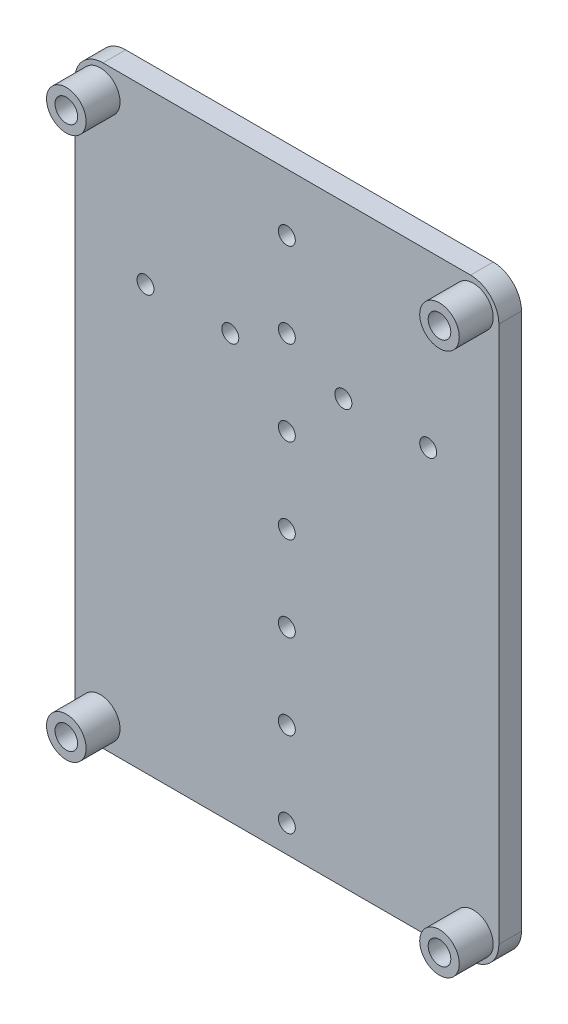
ISO-10303-21;
HEADER;
FILE_DESCRIPTION(('STEP AP214'),'2;1');
FILE_NAME('part.step','',(''),(''),'','','');
FILE_SCHEMA(('AUTOMOTIVE_DESIGN { 1 0 10303 214 1 1 1 1 }'));
ENDSEC;
DATA;
#1=APPLICATION_CONTEXT('core data for automotive mechanical design processes');
#2=APPLICATION_PROTOCOL_DEFINITION('international standard','automotive_design',2000,#1);
#3=PRODUCT_CONTEXT('',#1,'mechanical');
#4=PRODUCT('Part','Part','',(#3));
#5=PRODUCT_RELATED_PRODUCT_CATEGORY('part','',(#4));
#6=PRODUCT_DEFINITION_FORMATION('','',#4);
#7=PRODUCT_DEFINITION_CONTEXT('part definition',#1,'design');
#8=PRODUCT_DEFINITION('design','',#6,#7);
#9=PRODUCT_DEFINITION_SHAPE('','',#8);
#10=(LENGTH_UNIT() NAMED_UNIT(*) SI_UNIT(.MILLI.,.METRE.));
#11=(NAMED_UNIT(*) PLANE_ANGLE_UNIT() SI_UNIT($,.RADIAN.));
#12=(NAMED_UNIT(*) SI_UNIT($,.STERADIAN.) SOLID_ANGLE_UNIT());
#13=UNCERTAINTY_MEASURE_WITH_UNIT(LENGTH_MEASURE(1.E-05),#10,'distance_accuracy_value','');
#14=(GEOMETRIC_REPRESENTATION_CONTEXT(3) GLOBAL_UNCERTAINTY_ASSIGNED_CONTEXT((#13)) GLOBAL_UNIT_ASSIGNED_CONTEXT((#10,
#11,#12)) REPRESENTATION_CONTEXT('',''));
#15=CARTESIAN_POINT('',(0.,0.,0.));
#16=DIRECTION('',(0.,0.,1.));
#17=DIRECTION('',(1.,0.,0.));
#18=AXIS2_PLACEMENT_3D('',#15,#16,#17);
#19=CARTESIAN_POINT('',(0.,0.,116.694714262562));
#20=DIRECTION('',(0.,0.,-1.));
#21=DIRECTION('',(-1.,0.,0.));
#22=AXIS2_PLACEMENT_3D('',#19,#20,#21);
#23=PLANE('',#22);
#24=CARTESIAN_POINT('',(101.526557276723,64.3119182077676,116.694714262562));
#25=DIRECTION('',(0.,0.,-1.));
#26=DIRECTION('',(-1.,0.,0.));
#27=AXIS2_PLACEMENT_3D('',#24,#25,#26);
#28=CIRCLE('',#27,3.50000000000001);
#29=CARTESIAN_POINT('',(98.0265572767228,64.3119182077676,116.694714262562));
#30=VERTEX_POINT('',#29);
#31=EDGE_CURVE('E139',#30,#30,#28,.F.);
#32=ORIENTED_EDGE('',*,*,#31,.F.);
#33=EDGE_LOOP('',(#32));
#34=FACE_BOUND('',#33,.T.);
#35=CARTESIAN_POINT('',(101.526557276723,160.311918207768,116.694714262562));
#36=DIRECTION('',(0.,0.,-1.));
#37=DIRECTION('',(-1.,0.,0.));
#38=AXIS2_PLACEMENT_3D('',#35,#36,#37);
#39=CIRCLE('',#38,3.50000000000001);
#40=CARTESIAN_POINT('',(98.0265572767228,160.311918207768,116.694714262562));
#41=VERTEX_POINT('',#40);
#42=EDGE_CURVE('E132',#41,#41,#39,.F.);
#43=ORIENTED_EDGE('',*,*,#42,.F.);
#44=EDGE_LOOP('',(#43));
#45=FACE_BOUND('',#44,.T.);
#46=DIRECTION('',(0.,1.,0.));
#47=VECTOR('',#46,1.);
#48=CARTESIAN_POINT('',(97.0265572767228,164.811918207768,116.694714262562));
#49=LINE('',#48,#47);
#50=CARTESIAN_POINT('',(97.0265572767228,64.8119182077676,116.694714262562));
#51=VERTEX_POINT('',#50);
#52=CARTESIAN_POINT('',(97.0265572767228,159.811918207768,116.694714262562));
#53=VERTEX_POINT('',#52);
#54=EDGE_CURVE('E115',#51,#53,#49,.T.);
#55=ORIENTED_EDGE('',*,*,#54,.F.);
#56=CARTESIAN_POINT('',(102.026557276723,64.8119182077676,116.694714262562));
#57=DIRECTION('',(0.,0.,-1.));
#58=DIRECTION('',(-1.,0.,0.));
#59=AXIS2_PLACEMENT_3D('',#56,#57,#58);
#60=CIRCLE('',#59,5.);
#61=CARTESIAN_POINT('',(102.026557276723,59.8119182077676,116.694714262562));
#62=VERTEX_POINT('',#61);
#63=EDGE_CURVE('E98',#51,#62,#60,.F.);
#64=ORIENTED_EDGE('',*,*,#63,.T.);
#65=DIRECTION('',(-1.,0.,0.));
#66=VECTOR('',#65,1.);
#67=CARTESIAN_POINT('',(172.026557276723,59.8119182077676,116.694714262562));
#68=LINE('',#67,#66);
#69=CARTESIAN_POINT('',(167.026557276723,59.8119182077676,116.694714262562));
#70=VERTEX_POINT('',#69);
#71=EDGE_CURVE('E124',#70,#62,#68,.T.);
#72=ORIENTED_EDGE('',*,*,#71,.F.);
#73=CARTESIAN_POINT('',(167.026557276723,64.8119182077676,116.694714262562));
#74=DIRECTION('',(0.,0.,-1.));
#75=DIRECTION('',(-1.,0.,0.));
#76=AXIS2_PLACEMENT_3D('',#73,#74,#75);
#77=CIRCLE('',#76,5.);
#78=CARTESIAN_POINT('',(172.026557276723,64.8119182077676,116.694714262562));
#79=VERTEX_POINT('',#78);
#80=EDGE_CURVE('E109',#70,#79,#77,.F.);
#81=ORIENTED_EDGE('',*,*,#80,.T.);
#82=DIRECTION('',(0.,-1.,0.));
#83=VECTOR('',#82,1.);
#84=CARTESIAN_POINT('',(172.026557276723,164.811918207768,116.694714262562));
#85=LINE('',#84,#83);
#86=CARTESIAN_POINT('',(172.026557276723,159.811918207768,116.694714262562));
#87=VERTEX_POINT('',#86);
#88=EDGE_CURVE('E128',#87,#79,#85,.T.);
#89=ORIENTED_EDGE('',*,*,#88,.F.);
#90=CARTESIAN_POINT('',(167.026557276723,159.811918207768,116.694714262562));
#91=DIRECTION('',(0.,0.,-1.));
#92=DIRECTION('',(-1.,0.,0.));
#93=AXIS2_PLACEMENT_3D('',#90,#91,#92);
#94=CIRCLE('',#93,5.);
#95=CARTESIAN_POINT('',(167.026557276723,164.811918207768,116.694714262562));
#96=VERTEX_POINT('',#95);
#97=EDGE_CURVE('E147',#87,#96,#94,.F.);
#98=ORIENTED_EDGE('',*,*,#97,.T.);
#99=DIRECTION('',(1.,0.,0.));
#100=VECTOR('',#99,1.);
#101=CARTESIAN_POINT('',(172.026557276723,164.811918207768,116.694714262562));
#102=LINE('',#101,#100);
#103=CARTESIAN_POINT('',(102.026557276723,164.811918207768,116.694714262562));
#104=VERTEX_POINT('',#103);
#105=EDGE_CURVE('E123',#104,#96,#102,.T.);
#106=ORIENTED_EDGE('',*,*,#105,.F.);
#107=CARTESIAN_POINT('',(102.026557276723,159.811918207768,116.694714262562));
#108=DIRECTION('',(0.,0.,-1.));
#109=DIRECTION('',(-1.,0.,0.));
#110=AXIS2_PLACEMENT_3D('',#107,#108,#109);
#111=CIRCLE('',#110,5.);
#112=EDGE_CURVE('E118',#104,#53,#111,.F.);
#113=ORIENTED_EDGE('',*,*,#112,.T.);
#114=EDGE_LOOP('',(#55,#64,#72,#81,#89,#98,#106,#113));
#115=FACE_BOUND('',#114,.T.);
#116=CARTESIAN_POINT('',(134.526557276723,154.637085274738,116.694714262562));
#117=DIRECTION('',(0.,0.,-1.));
#118=DIRECTION('',(-1.,0.,0.));
#119=AXIS2_PLACEMENT_3D('',#116,#117,#118);
#120=CIRCLE('',#119,1.5);
#121=CARTESIAN_POINT('',(133.026557276723,154.637085274738,116.694714262562));
#122=VERTEX_POINT('',#121);
#123=EDGE_CURVE('E185',#122,#122,#120,.T.);
#124=ORIENTED_EDGE('',*,*,#123,.T.);
#125=EDGE_LOOP('',(#124));
#126=FACE_BOUND('',#125,.T.);
#127=CARTESIAN_POINT('',(134.526557276723,139.637085274738,116.694714262562));
#128=DIRECTION('',(0.,0.,-1.));
#129=DIRECTION('',(-1.,0.,0.));
#130=AXIS2_PLACEMENT_3D('',#127,#128,#129);
#131=CIRCLE('',#130,1.5);
#132=CARTESIAN_POINT('',(133.026557276723,139.637085274738,116.694714262562));
#133=VERTEX_POINT('',#132);
#134=EDGE_CURVE('E196',#133,#133,#131,.T.);
#135=ORIENTED_EDGE('',*,*,#134,.T.);
#136=EDGE_LOOP('',(#135));
#137=FACE_BOUND('',#136,.T.);
#138=CARTESIAN_POINT('',(144.526557276723,134.637085274738,116.694714262562));
#139=DIRECTION('',(0.,0.,-1.));
#140=DIRECTION('',(-1.,0.,0.));
#141=AXIS2_PLACEMENT_3D('',#138,#139,#140);
#142=CIRCLE('',#141,1.50000000000002);
#143=CARTESIAN_POINT('',(143.026557276723,134.637085274738,116.694714262562));
#144=VERTEX_POINT('',#143);
#145=EDGE_CURVE('E202',#144,#144,#142,.T.);
#146=ORIENTED_EDGE('',*,*,#145,.T.);
#147=EDGE_LOOP('',(#146));
#148=FACE_BOUND('',#147,.T.);
#149=CARTESIAN_POINT('',(159.526557276723,134.637085274738,116.694714262562));
#150=DIRECTION('',(0.,0.,-1.));
#151=DIRECTION('',(-1.,0.,0.));
#152=AXIS2_PLACEMENT_3D('',#149,#150,#151);
#153=CIRCLE('',#152,1.5);
#154=CARTESIAN_POINT('',(158.026557276723,134.637085274738,116.694714262562));
#155=VERTEX_POINT('',#154);
#156=EDGE_CURVE('E208',#155,#155,#153,.T.);
#157=ORIENTED_EDGE('',*,*,#156,.T.);
#158=EDGE_LOOP('',(#157));
#159=FACE_BOUND('',#158,.T.);
#160=CARTESIAN_POINT('',(124.526557276723,134.637085274738,116.694714262562));
#161=DIRECTION('',(0.,0.,-1.));
#162=DIRECTION('',(-1.,0.,0.));
#163=AXIS2_PLACEMENT_3D('',#160,#161,#162);
#164=CIRCLE('',#163,1.50000000000002);
#165=CARTESIAN_POINT('',(123.026557276723,134.637085274738,116.694714262562));
#166=VERTEX_POINT('',#165);
#167=EDGE_CURVE('E214',#166,#166,#164,.T.);
#168=ORIENTED_EDGE('',*,*,#167,.T.);
#169=EDGE_LOOP('',(#168));
#170=FACE_BOUND('',#169,.T.);
#171=CARTESIAN_POINT('',(109.526557276723,134.637085274738,116.694714262562));
#172=DIRECTION('',(0.,0.,-1.));
#173=DIRECTION('',(-1.,0.,0.));
#174=AXIS2_PLACEMENT_3D('',#171,#172,#173);
#175=CIRCLE('',#174,1.5);
#176=CARTESIAN_POINT('',(108.026557276723,134.637085274738,116.694714262562));
#177=VERTEX_POINT('',#176);
#178=EDGE_CURVE('E220',#177,#177,#175,.T.);
#179=ORIENTED_EDGE('',*,*,#178,.T.);
#180=EDGE_LOOP('',(#179));
#181=FACE_BOUND('',#180,.T.);
#182=CARTESIAN_POINT('',(134.526557276723,124.637085274738,116.694714262562));
#183=DIRECTION('',(0.,0.,-1.));
#184=DIRECTION('',(-1.,0.,0.));
#185=AXIS2_PLACEMENT_3D('',#182,#183,#184);
#186=CIRCLE('',#185,1.5);
#187=CARTESIAN_POINT('',(133.026557276723,124.637085274738,116.694714262562));
#188=VERTEX_POINT('',#187);
#189=EDGE_CURVE('E226',#188,#188,#186,.T.);
#190=ORIENTED_EDGE('',*,*,#189,.T.);
#191=EDGE_LOOP('',(#190));
#192=FACE_BOUND('',#191,.T.);
#193=CARTESIAN_POINT('',(134.526557276723,109.637085274738,116.694714262562));
#194=DIRECTION('',(0.,0.,-1.));
#195=DIRECTION('',(-1.,0.,0.));
#196=AXIS2_PLACEMENT_3D('',#193,#194,#195);
#197=CIRCLE('',#196,1.5);
#198=CARTESIAN_POINT('',(133.026557276723,109.637085274738,116.694714262562));
#199=VERTEX_POINT('',#198);
#200=EDGE_CURVE('E232',#199,#199,#197,.T.);
#201=ORIENTED_EDGE('',*,*,#200,.T.);
#202=EDGE_LOOP('',(#201));
#203=FACE_BOUND('',#202,.T.);
#204=CARTESIAN_POINT('',(134.526557276723,94.6370852747384,116.694714262562));
#205=DIRECTION('',(0.,0.,-1.));
#206=DIRECTION('',(-1.,0.,0.));
#207=AXIS2_PLACEMENT_3D('',#204,#205,#206);
#208=CIRCLE('',#207,1.5);
#209=CARTESIAN_POINT('',(133.026557276723,94.6370852747384,116.694714262562));
#210=VERTEX_POINT('',#209);
#211=EDGE_CURVE('E238',#210,#210,#208,.T.);
#212=ORIENTED_EDGE('',*,*,#211,.T.);
#213=EDGE_LOOP('',(#212));
#214=FACE_BOUND('',#213,.T.);
#215=CARTESIAN_POINT('',(134.526557276723,79.6370852747385,116.694714262562));
#216=DIRECTION('',(0.,0.,-1.));
#217=DIRECTION('',(-1.,0.,0.));
#218=AXIS2_PLACEMENT_3D('',#215,#216,#217);
#219=CIRCLE('',#218,1.5);
#220=CARTESIAN_POINT('',(133.026557276723,79.6370852747385,116.694714262562));
#221=VERTEX_POINT('',#220);
#222=EDGE_CURVE('E244',#221,#221,#219,.T.);
#223=ORIENTED_EDGE('',*,*,#222,.T.);
#224=EDGE_LOOP('',(#223));
#225=FACE_BOUND('',#224,.T.);
#226=CARTESIAN_POINT('',(134.526557276723,64.6370852747385,116.694714262562));
#227=DIRECTION('',(0.,0.,-1.));
#228=DIRECTION('',(-1.,0.,0.));
#229=AXIS2_PLACEMENT_3D('',#226,#227,#228);
#230=CIRCLE('',#229,1.5);
#231=CARTESIAN_POINT('',(133.026557276723,64.6370852747385,116.694714262562));
#232=VERTEX_POINT('',#231);
#233=EDGE_CURVE('E250',#232,#232,#230,.T.);
#234=ORIENTED_EDGE('',*,*,#233,.T.);
#235=EDGE_LOOP('',(#234));
#236=FACE_BOUND('',#235,.T.);
#237=CARTESIAN_POINT('',(167.526557276723,160.311918207768,116.694714262562));
#238=DIRECTION('',(0.,0.,-1.));
#239=DIRECTION('',(-1.,0.,0.));
#240=AXIS2_PLACEMENT_3D('',#237,#238,#239);
#241=CIRCLE('',#240,3.49999999999999);
#242=CARTESIAN_POINT('',(164.026557276723,160.311918207768,116.694714262562));
#243=VERTEX_POINT('',#242);
#244=EDGE_CURVE('E135',#243,#243,#241,.F.);
#245=ORIENTED_EDGE('',*,*,#244,.F.);
#246=EDGE_LOOP('',(#245));
#247=FACE_BOUND('',#246,.T.);
#248=CARTESIAN_POINT('',(167.526557276723,64.3119182077676,116.694714262562));
#249=DIRECTION('',(0.,0.,-1.));
#250=DIRECTION('',(-1.,0.,0.));
#251=AXIS2_PLACEMENT_3D('',#248,#249,#250);
#252=CIRCLE('',#251,3.49999999999999);
#253=CARTESIAN_POINT('',(164.026557276723,64.3119182077676,116.694714262562));
#254=VERTEX_POINT('',#253);
#255=EDGE_CURVE('E142',#254,#254,#252,.F.);
#256=ORIENTED_EDGE('',*,*,#255,.F.);
#257=EDGE_LOOP('',(#256));
#258=FACE_BOUND('',#257,.T.);
#259=ADVANCED_FACE('F33',(#34,#45,#115,#126,#137,#148,#159,#170,#181,#192,#203,#214,#225,#236,
#247,#258),#23,.F.);
#260=CARTESIAN_POINT('',(0.,0.,112.694714262562));
#261=DIRECTION('',(0.,0.,-1.));
#262=DIRECTION('',(-1.,0.,0.));
#263=AXIS2_PLACEMENT_3D('',#260,#261,#262);
#264=PLANE('',#263);
#265=CARTESIAN_POINT('',(101.526557276723,160.311918207768,112.694714262562));
#266=DIRECTION('',(0.,0.,-1.));
#267=DIRECTION('',(-1.,0.,0.));
#268=AXIS2_PLACEMENT_3D('',#265,#266,#267);
#269=CIRCLE('',#268,2.);
#270=CARTESIAN_POINT('',(99.5265572767228,160.311918207768,112.694714262562));
#271=VERTEX_POINT('',#270);
#272=EDGE_CURVE('E261',#271,#271,#269,.T.);
#273=ORIENTED_EDGE('',*,*,#272,.F.);
#274=EDGE_LOOP('',(#273));
#275=FACE_BOUND('',#274,.T.);
#276=CARTESIAN_POINT('',(167.526557276723,64.3119182077676,112.694714262562));
#277=DIRECTION('',(0.,0.,-1.));
#278=DIRECTION('',(-1.,0.,0.));
#279=AXIS2_PLACEMENT_3D('',#276,#277,#278);
#280=CIRCLE('',#279,2.);
#281=CARTESIAN_POINT('',(165.526557276723,64.3119182077676,112.694714262562));
#282=VERTEX_POINT('',#281);
#283=EDGE_CURVE('E253',#282,#282,#280,.T.);
#284=ORIENTED_EDGE('',*,*,#283,.F.);
#285=EDGE_LOOP('',(#284));
#286=FACE_BOUND('',#285,.T.);
#287=CARTESIAN_POINT('',(134.526557276723,79.6370852747385,112.694714262562));
#288=DIRECTION('',(0.,0.,-1.));
#289=DIRECTION('',(-1.,0.,0.));
#290=AXIS2_PLACEMENT_3D('',#287,#288,#289);
#291=CIRCLE('',#290,1.5);
#292=CARTESIAN_POINT('',(133.026557276723,79.6370852747385,112.694714262562));
#293=VERTEX_POINT('',#292);
#294=EDGE_CURVE('E241',#293,#293,#291,.T.);
#295=ORIENTED_EDGE('',*,*,#294,.F.);
#296=EDGE_LOOP('',(#295));
#297=FACE_BOUND('',#296,.T.);
#298=CARTESIAN_POINT('',(134.526557276723,109.637085274738,112.694714262562));
#299=DIRECTION('',(0.,0.,-1.));
#300=DIRECTION('',(-1.,0.,0.));
#301=AXIS2_PLACEMENT_3D('',#298,#299,#300);
#302=CIRCLE('',#301,1.5);
#303=CARTESIAN_POINT('',(133.026557276723,109.637085274738,112.694714262562));
#304=VERTEX_POINT('',#303);
#305=EDGE_CURVE('E229',#304,#304,#302,.T.);
#306=ORIENTED_EDGE('',*,*,#305,.F.);
#307=EDGE_LOOP('',(#306));
#308=FACE_BOUND('',#307,.T.);
#309=CARTESIAN_POINT('',(109.526557276723,134.637085274738,112.694714262562));
#310=DIRECTION('',(0.,0.,-1.));
#311=DIRECTION('',(-1.,0.,0.));
#312=AXIS2_PLACEMENT_3D('',#309,#310,#311);
#313=CIRCLE('',#312,1.5);
#314=CARTESIAN_POINT('',(108.026557276723,134.637085274738,112.694714262562));
#315=VERTEX_POINT('',#314);
#316=EDGE_CURVE('E217',#315,#315,#313,.T.);
#317=ORIENTED_EDGE('',*,*,#316,.F.);
#318=EDGE_LOOP('',(#317));
#319=FACE_BOUND('',#318,.T.);
#320=CARTESIAN_POINT('',(159.526557276723,134.637085274738,112.694714262562));
#321=DIRECTION('',(0.,0.,-1.));
#322=DIRECTION('',(-1.,0.,0.));
#323=AXIS2_PLACEMENT_3D('',#320,#321,#322);
#324=CIRCLE('',#323,1.5);
#325=CARTESIAN_POINT('',(158.026557276723,134.637085274738,112.694714262562));
#326=VERTEX_POINT('',#325);
#327=EDGE_CURVE('E205',#326,#326,#324,.T.);
#328=ORIENTED_EDGE('',*,*,#327,.F.);
#329=EDGE_LOOP('',(#328));
#330=FACE_BOUND('',#329,.T.);
#331=CARTESIAN_POINT('',(134.526557276723,139.637085274738,112.694714262562));
#332=DIRECTION('',(0.,0.,-1.));
#333=DIRECTION('',(-1.,0.,0.));
#334=AXIS2_PLACEMENT_3D('',#331,#332,#333);
#335=CIRCLE('',#334,1.5);
#336=CARTESIAN_POINT('',(133.026557276723,139.637085274738,112.694714262562));
#337=VERTEX_POINT('',#336);
#338=EDGE_CURVE('E194',#337,#337,#335,.T.);
#339=ORIENTED_EDGE('',*,*,#338,.F.);
#340=EDGE_LOOP('',(#339));
#341=FACE_BOUND('',#340,.T.);
#342=DIRECTION('',(-1.,0.,0.));
#343=VECTOR('',#342,1.);
#344=CARTESIAN_POINT('',(172.026557276723,59.8119182077676,112.694714262562));
#345=LINE('',#344,#343);
#346=CARTESIAN_POINT('',(167.026557276723,59.8119182077676,112.694714262562));
#347=VERTEX_POINT('',#346);
#348=CARTESIAN_POINT('',(102.026557276723,59.8119182077676,112.694714262562));
#349=VERTEX_POINT('',#348);
#350=EDGE_CURVE('E180',#347,#349,#345,.T.);
#351=ORIENTED_EDGE('',*,*,#350,.T.);
#352=CARTESIAN_POINT('',(102.026557276723,64.8119182077676,112.694714262562));
#353=DIRECTION('',(0.,0.,-1.));
#354=DIRECTION('',(-1.,0.,0.));
#355=AXIS2_PLACEMENT_3D('',#352,#353,#354);
#356=CIRCLE('',#355,5.);
#357=CARTESIAN_POINT('',(97.0265572767228,64.8119182077676,112.694714262562));
#358=VERTEX_POINT('',#357);
#359=EDGE_CURVE('E158',#349,#358,#356,.T.);
#360=ORIENTED_EDGE('',*,*,#359,.T.);
#361=DIRECTION('',(0.,1.,0.));
#362=VECTOR('',#361,1.);
#363=CARTESIAN_POINT('',(97.0265572767228,164.811918207768,112.694714262562));
#364=LINE('',#363,#362);
#365=CARTESIAN_POINT('',(97.0265572767228,159.811918207768,112.694714262562));
#366=VERTEX_POINT('',#365);
#367=EDGE_CURVE('E117',#358,#366,#364,.T.);
#368=ORIENTED_EDGE('',*,*,#367,.T.);
#369=CARTESIAN_POINT('',(102.026557276723,159.811918207768,112.694714262562));
#370=DIRECTION('',(0.,0.,-1.));
#371=DIRECTION('',(-1.,0.,0.));
#372=AXIS2_PLACEMENT_3D('',#369,#370,#371);
#373=CIRCLE('',#372,5.);
#374=CARTESIAN_POINT('',(102.026557276723,164.811918207768,112.694714262562));
#375=VERTEX_POINT('',#374);
#376=EDGE_CURVE('E53',#366,#375,#373,.T.);
#377=ORIENTED_EDGE('',*,*,#376,.T.);
#378=DIRECTION('',(1.,0.,0.));
#379=VECTOR('',#378,1.);
#380=CARTESIAN_POINT('',(172.026557276723,164.811918207768,112.694714262562));
#381=LINE('',#380,#379);
#382=CARTESIAN_POINT('',(167.026557276723,164.811918207768,112.694714262562));
#383=VERTEX_POINT('',#382);
#384=EDGE_CURVE('E136',#375,#383,#381,.T.);
#385=ORIENTED_EDGE('',*,*,#384,.T.);
#386=CARTESIAN_POINT('',(167.026557276723,159.811918207768,112.694714262562));
#387=DIRECTION('',(0.,0.,-1.));
#388=DIRECTION('',(-1.,0.,0.));
#389=AXIS2_PLACEMENT_3D('',#386,#387,#388);
#390=CIRCLE('',#389,5.);
#391=CARTESIAN_POINT('',(172.026557276723,159.811918207768,112.694714262562));
#392=VERTEX_POINT('',#391);
#393=EDGE_CURVE('E154',#383,#392,#390,.T.);
#394=ORIENTED_EDGE('',*,*,#393,.T.);
#395=DIRECTION('',(0.,-1.,0.));
#396=VECTOR('',#395,1.);
#397=CARTESIAN_POINT('',(172.026557276723,164.811918207768,112.694714262562));
#398=LINE('',#397,#396);
#399=CARTESIAN_POINT('',(172.026557276723,64.8119182077676,112.694714262562));
#400=VERTEX_POINT('',#399);
#401=EDGE_CURVE('E126',#392,#400,#398,.T.);
#402=ORIENTED_EDGE('',*,*,#401,.T.);
#403=CARTESIAN_POINT('',(167.026557276723,64.8119182077676,112.694714262562));
#404=DIRECTION('',(0.,0.,-1.));
#405=DIRECTION('',(-1.,0.,0.));
#406=AXIS2_PLACEMENT_3D('',#403,#404,#405);
#407=CIRCLE('',#406,5.);
#408=EDGE_CURVE('E156',#400,#347,#407,.T.);
#409=ORIENTED_EDGE('',*,*,#408,.T.);
#410=EDGE_LOOP('',(#351,#360,#368,#377,#385,#394,#402,#409));
#411=FACE_BOUND('',#410,.T.);
#412=CARTESIAN_POINT('',(134.526557276723,154.637085274738,112.694714262562));
#413=DIRECTION('',(0.,0.,-1.));
#414=DIRECTION('',(-1.,0.,0.));
#415=AXIS2_PLACEMENT_3D('',#412,#413,#414);
#416=CIRCLE('',#415,1.5);
#417=CARTESIAN_POINT('',(133.026557276723,154.637085274738,112.694714262562));
#418=VERTEX_POINT('',#417);
#419=EDGE_CURVE('E189',#418,#418,#416,.T.);
#420=ORIENTED_EDGE('',*,*,#419,.F.);
#421=EDGE_LOOP('',(#420));
#422=FACE_BOUND('',#421,.T.);
#423=CARTESIAN_POINT('',(144.526557276723,134.637085274738,112.694714262562));
#424=DIRECTION('',(0.,0.,-1.));
#425=DIRECTION('',(-1.,0.,0.));
#426=AXIS2_PLACEMENT_3D('',#423,#424,#425);
#427=CIRCLE('',#426,1.50000000000002);
#428=CARTESIAN_POINT('',(143.026557276723,134.637085274738,112.694714262562));
#429=VERTEX_POINT('',#428);
#430=EDGE_CURVE('E199',#429,#429,#427,.T.);
#431=ORIENTED_EDGE('',*,*,#430,.F.);
#432=EDGE_LOOP('',(#431));
#433=FACE_BOUND('',#432,.T.);
#434=CARTESIAN_POINT('',(124.526557276723,134.637085274738,112.694714262562));
#435=DIRECTION('',(0.,0.,-1.));
#436=DIRECTION('',(-1.,0.,0.));
#437=AXIS2_PLACEMENT_3D('',#434,#435,#436);
#438=CIRCLE('',#437,1.50000000000002);
#439=CARTESIAN_POINT('',(123.026557276723,134.637085274738,112.694714262562));
#440=VERTEX_POINT('',#439);
#441=EDGE_CURVE('E211',#440,#440,#438,.T.);
#442=ORIENTED_EDGE('',*,*,#441,.F.);
#443=EDGE_LOOP('',(#442));
#444=FACE_BOUND('',#443,.T.);
#445=CARTESIAN_POINT('',(134.526557276723,124.637085274738,112.694714262562));
#446=DIRECTION('',(0.,0.,-1.));
#447=DIRECTION('',(-1.,0.,0.));
#448=AXIS2_PLACEMENT_3D('',#445,#446,#447);
#449=CIRCLE('',#448,1.5);
#450=CARTESIAN_POINT('',(133.026557276723,124.637085274738,112.694714262562));
#451=VERTEX_POINT('',#450);
#452=EDGE_CURVE('E223',#451,#451,#449,.T.);
#453=ORIENTED_EDGE('',*,*,#452,.F.);
#454=EDGE_LOOP('',(#453));
#455=FACE_BOUND('',#454,.T.);
#456=CARTESIAN_POINT('',(134.526557276723,94.6370852747384,112.694714262562));
#457=DIRECTION('',(0.,0.,-1.));
#458=DIRECTION('',(-1.,0.,0.));
#459=AXIS2_PLACEMENT_3D('',#456,#457,#458);
#460=CIRCLE('',#459,1.5);
#461=CARTESIAN_POINT('',(133.026557276723,94.6370852747384,112.694714262562));
#462=VERTEX_POINT('',#461);
#463=EDGE_CURVE('E235',#462,#462,#460,.T.);
#464=ORIENTED_EDGE('',*,*,#463,.F.);
#465=EDGE_LOOP('',(#464));
#466=FACE_BOUND('',#465,.T.);
#467=CARTESIAN_POINT('',(134.526557276723,64.6370852747385,112.694714262562));
#468=DIRECTION('',(0.,0.,-1.));
#469=DIRECTION('',(-1.,0.,0.));
#470=AXIS2_PLACEMENT_3D('',#467,#468,#469);
#471=CIRCLE('',#470,1.5);
#472=CARTESIAN_POINT('',(133.026557276723,64.6370852747385,112.694714262562));
#473=VERTEX_POINT('',#472);
#474=EDGE_CURVE('E247',#473,#473,#471,.T.);
#475=ORIENTED_EDGE('',*,*,#474,.F.);
#476=EDGE_LOOP('',(#475));
#477=FACE_BOUND('',#476,.T.);
#478=CARTESIAN_POINT('',(101.526557276723,64.3119182077676,112.694714262562));
#479=DIRECTION('',(0.,0.,-1.));
#480=DIRECTION('',(-1.,0.,0.));
#481=AXIS2_PLACEMENT_3D('',#478,#479,#480);
#482=CIRCLE('',#481,2.);
#483=CARTESIAN_POINT('',(99.5265572767228,64.3119182077676,112.694714262562));
#484=VERTEX_POINT('',#483);
#485=EDGE_CURVE('E258',#484,#484,#482,.T.);
#486=ORIENTED_EDGE('',*,*,#485,.F.);
#487=EDGE_LOOP('',(#486));
#488=FACE_BOUND('',#487,.T.);
#489=CARTESIAN_POINT('',(167.526557276723,160.311918207768,112.694714262562));
#490=DIRECTION('',(0.,0.,-1.));
#491=DIRECTION('',(-1.,0.,0.));
#492=AXIS2_PLACEMENT_3D('',#489,#490,#491);
#493=CIRCLE('',#492,2.);
#494=CARTESIAN_POINT('',(165.526557276723,160.311918207768,112.694714262562));
#495=VERTEX_POINT('',#494);
#496=EDGE_CURVE('E264',#495,#495,#493,.T.);
#497=ORIENTED_EDGE('',*,*,#496,.F.);
#498=EDGE_LOOP('',(#497));
#499=FACE_BOUND('',#498,.T.);
#500=ADVANCED_FACE('F310',(#275,#286,#297,#308,#319,#330,#341,#411,#422,#433,#444,#455,#466,
#477,#488,#499),#264,.T.);
#501=CARTESIAN_POINT('',(172.026557276723,164.811918207768,112.694714262562));
#502=DIRECTION('',(-1.,0.,0.));
#503=DIRECTION('',(0.,0.,1.));
#504=AXIS2_PLACEMENT_3D('',#501,#502,#503);
#505=PLANE('',#504);
#506=ORIENTED_EDGE('',*,*,#88,.T.);
#507=DIRECTION('',(0.,0.,1.));
#508=VECTOR('',#507,1.);
#509=CARTESIAN_POINT('',(172.026557276723,64.8119182077676,112.694714262562));
#510=LINE('',#509,#508);
#511=EDGE_CURVE('E163',#79,#400,#510,.F.);
#512=ORIENTED_EDGE('',*,*,#511,.T.);
#513=ORIENTED_EDGE('',*,*,#401,.F.);
#514=DIRECTION('',(0.,0.,1.));
#515=VECTOR('',#514,1.);
#516=CARTESIAN_POINT('',(172.026557276723,159.811918207768,112.694714262562));
#517=LINE('',#516,#515);
#518=EDGE_CURVE('E160',#392,#87,#517,.T.);
#519=ORIENTED_EDGE('',*,*,#518,.T.);
#520=EDGE_LOOP('',(#506,#512,#513,#519));
#521=FACE_BOUND('',#520,.T.);
#522=ADVANCED_FACE('F176',(#521),#505,.F.);
#523=CARTESIAN_POINT('',(172.026557276723,59.8119182077676,112.694714262562));
#524=DIRECTION('',(0.,1.,0.));
#525=DIRECTION('',(0.,0.,1.));
#526=AXIS2_PLACEMENT_3D('',#523,#524,#525);
#527=PLANE('',#526);
#528=ORIENTED_EDGE('',*,*,#71,.T.);
#529=DIRECTION('',(0.,0.,1.));
#530=VECTOR('',#529,1.);
#531=CARTESIAN_POINT('',(102.026557276723,59.8119182077676,112.694714262562));
#532=LINE('',#531,#530);
#533=EDGE_CURVE('E103',#62,#349,#532,.F.);
#534=ORIENTED_EDGE('',*,*,#533,.T.);
#535=ORIENTED_EDGE('',*,*,#350,.F.);
#536=DIRECTION('',(0.,0.,1.));
#537=VECTOR('',#536,1.);
#538=CARTESIAN_POINT('',(167.026557276723,59.8119182077676,112.694714262562));
#539=LINE('',#538,#537);
#540=EDGE_CURVE('E108',#347,#70,#539,.T.);
#541=ORIENTED_EDGE('',*,*,#540,.T.);
#542=EDGE_LOOP('',(#528,#534,#535,#541));
#543=FACE_BOUND('',#542,.T.);
#544=ADVANCED_FACE('F327',(#543),#527,.F.);
#545=CARTESIAN_POINT('',(97.0265572767228,164.811918207768,112.694714262562));
#546=DIRECTION('',(1.,0.,0.));
#547=DIRECTION('',(0.,0.,-1.));
#548=AXIS2_PLACEMENT_3D('',#545,#546,#547);
#549=PLANE('',#548);
#550=ORIENTED_EDGE('',*,*,#367,.F.);
#551=DIRECTION('',(0.,0.,1.));
#552=VECTOR('',#551,1.);
#553=CARTESIAN_POINT('',(97.0265572767228,64.8119182077676,112.694714262562));
#554=LINE('',#553,#552);
#555=EDGE_CURVE('E102',#358,#51,#554,.T.);
#556=ORIENTED_EDGE('',*,*,#555,.T.);
#557=ORIENTED_EDGE('',*,*,#54,.T.);
#558=DIRECTION('',(0.,0.,1.));
#559=VECTOR('',#558,1.);
#560=CARTESIAN_POINT('',(97.0265572767228,159.811918207768,112.694714262562));
#561=LINE('',#560,#559);
#562=EDGE_CURVE('E119',#53,#366,#561,.F.);
#563=ORIENTED_EDGE('',*,*,#562,.T.);
#564=EDGE_LOOP('',(#550,#556,#557,#563));
#565=FACE_BOUND('',#564,.T.);
#566=ADVANCED_FACE('F114',(#565),#549,.F.);
#567=CARTESIAN_POINT('',(172.026557276723,164.811918207768,112.694714262562));
#568=DIRECTION('',(0.,-1.,0.));
#569=DIRECTION('',(0.,0.,-1.));
#570=AXIS2_PLACEMENT_3D('',#567,#568,#569);
#571=PLANE('',#570);
#572=ORIENTED_EDGE('',*,*,#105,.T.);
#573=DIRECTION('',(0.,0.,1.));
#574=VECTOR('',#573,1.);
#575=CARTESIAN_POINT('',(167.026557276723,164.811918207768,112.694714262562));
#576=LINE('',#575,#574);
#577=EDGE_CURVE('E11',#96,#383,#576,.F.);
#578=ORIENTED_EDGE('',*,*,#577,.T.);
#579=ORIENTED_EDGE('',*,*,#384,.F.);
#580=DIRECTION('',(0.,0.,1.));
#581=VECTOR('',#580,1.);
#582=CARTESIAN_POINT('',(102.026557276723,164.811918207768,112.694714262562));
#583=LINE('',#582,#581);
#584=EDGE_CURVE('E41',#375,#104,#583,.T.);
#585=ORIENTED_EDGE('',*,*,#584,.T.);
#586=EDGE_LOOP('',(#572,#578,#579,#585));
#587=FACE_BOUND('',#586,.T.);
#588=ADVANCED_FACE('F166',(#587),#571,.F.);
#589=CARTESIAN_POINT('',(134.526557276723,154.637085274738,112.694714262562));
#590=DIRECTION('',(0.,0.,1.));
#591=DIRECTION('',(1.,0.,0.));
#592=AXIS2_PLACEMENT_3D('',#589,#590,#591);
#593=CYLINDRICAL_SURFACE('',#592,1.5);
#594=ORIENTED_EDGE('',*,*,#419,.T.);
#595=EDGE_LOOP('',(#594));
#596=FACE_BOUND('',#595,.T.);
#597=ORIENTED_EDGE('',*,*,#123,.F.);
#598=EDGE_LOOP('',(#597));
#599=FACE_BOUND('',#598,.T.);
#600=ADVANCED_FACE('F324',(#596,#599),#593,.F.);
#601=CARTESIAN_POINT('',(134.526557276723,139.637085274738,112.694714262562));
#602=DIRECTION('',(0.,0.,1.));
#603=DIRECTION('',(1.,0.,0.));
#604=AXIS2_PLACEMENT_3D('',#601,#602,#603);
#605=CYLINDRICAL_SURFACE('',#604,1.5);
#606=ORIENTED_EDGE('',*,*,#338,.T.);
#607=EDGE_LOOP('',(#606));
#608=FACE_BOUND('',#607,.T.);
#609=ORIENTED_EDGE('',*,*,#134,.F.);
#610=EDGE_LOOP('',(#609));
#611=FACE_BOUND('',#610,.T.);
#612=ADVANCED_FACE('F434',(#608,#611),#605,.F.);
#613=CARTESIAN_POINT('',(144.526557276723,134.637085274738,112.694714262562));
#614=DIRECTION('',(0.,0.,1.));
#615=DIRECTION('',(1.,0.,0.));
#616=AXIS2_PLACEMENT_3D('',#613,#614,#615);
#617=CYLINDRICAL_SURFACE('',#616,1.50000000000002);
#618=ORIENTED_EDGE('',*,*,#430,.T.);
#619=EDGE_LOOP('',(#618));
#620=FACE_BOUND('',#619,.T.);
#621=ORIENTED_EDGE('',*,*,#145,.F.);
#622=EDGE_LOOP('',(#621));
#623=FACE_BOUND('',#622,.T.);
#624=ADVANCED_FACE('F430',(#620,#623),#617,.F.);
#625=CARTESIAN_POINT('',(159.526557276723,134.637085274738,112.694714262562));
#626=DIRECTION('',(0.,0.,1.));
#627=DIRECTION('',(1.,0.,0.));
#628=AXIS2_PLACEMENT_3D('',#625,#626,#627);
#629=CYLINDRICAL_SURFACE('',#628,1.5);
#630=ORIENTED_EDGE('',*,*,#327,.T.);
#631=EDGE_LOOP('',(#630));
#632=FACE_BOUND('',#631,.T.);
#633=ORIENTED_EDGE('',*,*,#156,.F.);
#634=EDGE_LOOP('',(#633));
#635=FACE_BOUND('',#634,.T.);
#636=ADVANCED_FACE('F426',(#632,#635),#629,.F.);
#637=CARTESIAN_POINT('',(124.526557276723,134.637085274738,112.694714262562));
#638=DIRECTION('',(0.,0.,1.));
#639=DIRECTION('',(1.,0.,0.));
#640=AXIS2_PLACEMENT_3D('',#637,#638,#639);
#641=CYLINDRICAL_SURFACE('',#640,1.50000000000002);
#642=ORIENTED_EDGE('',*,*,#441,.T.);
#643=EDGE_LOOP('',(#642));
#644=FACE_BOUND('',#643,.T.);
#645=ORIENTED_EDGE('',*,*,#167,.F.);
#646=EDGE_LOOP('',(#645));
#647=FACE_BOUND('',#646,.T.);
#648=ADVANCED_FACE('F422',(#644,#647),#641,.F.);
#649=CARTESIAN_POINT('',(109.526557276723,134.637085274738,112.694714262562));
#650=DIRECTION('',(0.,0.,1.));
#651=DIRECTION('',(1.,0.,0.));
#652=AXIS2_PLACEMENT_3D('',#649,#650,#651);
#653=CYLINDRICAL_SURFACE('',#652,1.5);
#654=ORIENTED_EDGE('',*,*,#316,.T.);
#655=EDGE_LOOP('',(#654));
#656=FACE_BOUND('',#655,.T.);
#657=ORIENTED_EDGE('',*,*,#178,.F.);
#658=EDGE_LOOP('',(#657));
#659=FACE_BOUND('',#658,.T.);
#660=ADVANCED_FACE('F418',(#656,#659),#653,.F.);
#661=CARTESIAN_POINT('',(134.526557276723,124.637085274738,112.694714262562));
#662=DIRECTION('',(0.,0.,1.));
#663=DIRECTION('',(1.,0.,0.));
#664=AXIS2_PLACEMENT_3D('',#661,#662,#663);
#665=CYLINDRICAL_SURFACE('',#664,1.5);
#666=ORIENTED_EDGE('',*,*,#452,.T.);
#667=EDGE_LOOP('',(#666));
#668=FACE_BOUND('',#667,.T.);
#669=ORIENTED_EDGE('',*,*,#189,.F.);
#670=EDGE_LOOP('',(#669));
#671=FACE_BOUND('',#670,.T.);
#672=ADVANCED_FACE('F414',(#668,#671),#665,.F.);
#673=CARTESIAN_POINT('',(134.526557276723,109.637085274738,112.694714262562));
#674=DIRECTION('',(0.,0.,1.));
#675=DIRECTION('',(1.,0.,0.));
#676=AXIS2_PLACEMENT_3D('',#673,#674,#675);
#677=CYLINDRICAL_SURFACE('',#676,1.5);
#678=ORIENTED_EDGE('',*,*,#305,.T.);
#679=EDGE_LOOP('',(#678));
#680=FACE_BOUND('',#679,.T.);
#681=ORIENTED_EDGE('',*,*,#200,.F.);
#682=EDGE_LOOP('',(#681));
#683=FACE_BOUND('',#682,.T.);
#684=ADVANCED_FACE('F410',(#680,#683),#677,.F.);
#685=CARTESIAN_POINT('',(134.526557276723,94.6370852747384,112.694714262562));
#686=DIRECTION('',(0.,0.,1.));
#687=DIRECTION('',(1.,0.,0.));
#688=AXIS2_PLACEMENT_3D('',#685,#686,#687);
#689=CYLINDRICAL_SURFACE('',#688,1.5);
#690=ORIENTED_EDGE('',*,*,#463,.T.);
#691=EDGE_LOOP('',(#690));
#692=FACE_BOUND('',#691,.T.);
#693=ORIENTED_EDGE('',*,*,#211,.F.);
#694=EDGE_LOOP('',(#693));
#695=FACE_BOUND('',#694,.T.);
#696=ADVANCED_FACE('F406',(#692,#695),#689,.F.);
#697=CARTESIAN_POINT('',(134.526557276723,79.6370852747385,112.694714262562));
#698=DIRECTION('',(0.,0.,1.));
#699=DIRECTION('',(1.,0.,0.));
#700=AXIS2_PLACEMENT_3D('',#697,#698,#699);
#701=CYLINDRICAL_SURFACE('',#700,1.5);
#702=ORIENTED_EDGE('',*,*,#294,.T.);
#703=EDGE_LOOP('',(#702));
#704=FACE_BOUND('',#703,.T.);
#705=ORIENTED_EDGE('',*,*,#222,.F.);
#706=EDGE_LOOP('',(#705));
#707=FACE_BOUND('',#706,.T.);
#708=ADVANCED_FACE('F402',(#704,#707),#701,.F.);
#709=CARTESIAN_POINT('',(134.526557276723,64.6370852747385,112.694714262562));
#710=DIRECTION('',(0.,0.,1.));
#711=DIRECTION('',(1.,0.,0.));
#712=AXIS2_PLACEMENT_3D('',#709,#710,#711);
#713=CYLINDRICAL_SURFACE('',#712,1.5);
#714=ORIENTED_EDGE('',*,*,#474,.T.);
#715=EDGE_LOOP('',(#714));
#716=FACE_BOUND('',#715,.T.);
#717=ORIENTED_EDGE('',*,*,#233,.F.);
#718=EDGE_LOOP('',(#717));
#719=FACE_BOUND('',#718,.T.);
#720=ADVANCED_FACE('F398',(#716,#719),#713,.F.);
#721=CARTESIAN_POINT('',(167.526557276723,64.3119182077676,112.694714262562));
#722=DIRECTION('',(0.,0.,1.));
#723=DIRECTION('',(1.,0.,0.));
#724=AXIS2_PLACEMENT_3D('',#721,#722,#723);
#725=CYLINDRICAL_SURFACE('',#724,2.);
#726=ORIENTED_EDGE('',*,*,#283,.T.);
#727=EDGE_LOOP('',(#726));
#728=FACE_BOUND('',#727,.T.);
#729=CARTESIAN_POINT('',(167.526557276723,64.3119182077676,122.694714262562));
#730=DIRECTION('',(0.,0.,1.));
#731=DIRECTION('',(1.,0.,0.));
#732=AXIS2_PLACEMENT_3D('',#729,#730,#731);
#733=CIRCLE('',#732,2.);
#734=CARTESIAN_POINT('',(169.526557276723,64.3119182077676,122.694714262562));
#735=VERTEX_POINT('',#734);
#736=EDGE_CURVE('E288',#735,#735,#733,.T.);
#737=ORIENTED_EDGE('',*,*,#736,.T.);
#738=EDGE_LOOP('',(#737));
#739=FACE_BOUND('',#738,.T.);
#740=ADVANCED_FACE('F292',(#728,#739),#725,.F.);
#741=CARTESIAN_POINT('',(101.526557276723,64.3119182077676,112.694714262562));
#742=DIRECTION('',(0.,0.,1.));
#743=DIRECTION('',(1.,0.,0.));
#744=AXIS2_PLACEMENT_3D('',#741,#742,#743);
#745=CYLINDRICAL_SURFACE('',#744,2.);
#746=ORIENTED_EDGE('',*,*,#485,.T.);
#747=EDGE_LOOP('',(#746));
#748=FACE_BOUND('',#747,.T.);
#749=CARTESIAN_POINT('',(101.526557276723,64.3119182077676,122.694714262562));
#750=DIRECTION('',(0.,0.,1.));
#751=DIRECTION('',(1.,0.,0.));
#752=AXIS2_PLACEMENT_3D('',#749,#750,#751);
#753=CIRCLE('',#752,2.00000000000001);
#754=CARTESIAN_POINT('',(103.526557276723,64.3119182077676,122.694714262562));
#755=VERTEX_POINT('',#754);
#756=EDGE_CURVE('E282',#755,#755,#753,.T.);
#757=ORIENTED_EDGE('',*,*,#756,.T.);
#758=EDGE_LOOP('',(#757));
#759=FACE_BOUND('',#758,.T.);
#760=ADVANCED_FACE('F391',(#748,#759),#745,.F.);
#761=CARTESIAN_POINT('',(101.526557276723,160.311918207768,112.694714262562));
#762=DIRECTION('',(0.,0.,1.));
#763=DIRECTION('',(1.,0.,0.));
#764=AXIS2_PLACEMENT_3D('',#761,#762,#763);
#765=CYLINDRICAL_SURFACE('',#764,2.);
#766=ORIENTED_EDGE('',*,*,#272,.T.);
#767=EDGE_LOOP('',(#766));
#768=FACE_BOUND('',#767,.T.);
#769=CARTESIAN_POINT('',(101.526557276723,160.311918207768,122.694714262562));
#770=DIRECTION('',(0.,0.,1.));
#771=DIRECTION('',(1.,0.,0.));
#772=AXIS2_PLACEMENT_3D('',#769,#770,#771);
#773=CIRCLE('',#772,2.00000000000001);
#774=CARTESIAN_POINT('',(103.526557276723,160.311918207768,122.694714262562));
#775=VERTEX_POINT('',#774);
#776=EDGE_CURVE('E270',#775,#775,#773,.T.);
#777=ORIENTED_EDGE('',*,*,#776,.T.);
#778=EDGE_LOOP('',(#777));
#779=FACE_BOUND('',#778,.T.);
#780=ADVANCED_FACE('F366',(#768,#779),#765,.F.);
#781=CARTESIAN_POINT('',(167.526557276723,160.311918207768,112.694714262562));
#782=DIRECTION('',(0.,0.,1.));
#783=DIRECTION('',(1.,0.,0.));
#784=AXIS2_PLACEMENT_3D('',#781,#782,#783);
#785=CYLINDRICAL_SURFACE('',#784,2.);
#786=ORIENTED_EDGE('',*,*,#496,.T.);
#787=EDGE_LOOP('',(#786));
#788=FACE_BOUND('',#787,.T.);
#789=CARTESIAN_POINT('',(167.526557276723,160.311918207768,122.694714262562));
#790=DIRECTION('',(0.,0.,1.));
#791=DIRECTION('',(1.,0.,0.));
#792=AXIS2_PLACEMENT_3D('',#789,#790,#791);
#793=CIRCLE('',#792,2.);
#794=CARTESIAN_POINT('',(169.526557276723,160.311918207768,122.694714262562));
#795=VERTEX_POINT('',#794);
#796=EDGE_CURVE('E276',#795,#795,#793,.T.);
#797=ORIENTED_EDGE('',*,*,#796,.T.);
#798=EDGE_LOOP('',(#797));
#799=FACE_BOUND('',#798,.T.);
#800=ADVANCED_FACE('F362',(#788,#799),#785,.F.);
#801=CARTESIAN_POINT('',(101.526557276723,160.311918207768,122.694714262562));
#802=DIRECTION('',(0.,0.,1.));
#803=DIRECTION('',(1.,0.,0.));
#804=AXIS2_PLACEMENT_3D('',#801,#802,#803);
#805=PLANE('',#804);
#806=CARTESIAN_POINT('',(101.526557276723,160.311918207768,122.694714262562));
#807=DIRECTION('',(0.,0.,1.));
#808=DIRECTION('',(1.,0.,0.));
#809=AXIS2_PLACEMENT_3D('',#806,#807,#808);
#810=CIRCLE('',#809,3.50000000000001);
#811=CARTESIAN_POINT('',(105.026557276723,160.311918207768,122.694714262562));
#812=VERTEX_POINT('',#811);
#813=EDGE_CURVE('E267',#812,#812,#810,.T.);
#814=ORIENTED_EDGE('',*,*,#813,.T.);
#815=EDGE_LOOP('',(#814));
#816=FACE_BOUND('',#815,.T.);
#817=ORIENTED_EDGE('',*,*,#776,.F.);
#818=EDGE_LOOP('',(#817));
#819=FACE_BOUND('',#818,.T.);
#820=ADVANCED_FACE('F365',(#816,#819),#805,.T.);
#821=CARTESIAN_POINT('',(101.526557276723,160.311918207768,122.694714262562));
#822=DIRECTION('',(0.,0.,-1.));
#823=DIRECTION('',(-1.,0.,0.));
#824=AXIS2_PLACEMENT_3D('',#821,#822,#823);
#825=CYLINDRICAL_SURFACE('',#824,3.50000000000001);
#826=ORIENTED_EDGE('',*,*,#813,.F.);
#827=EDGE_LOOP('',(#826));
#828=FACE_BOUND('',#827,.T.);
#829=ORIENTED_EDGE('',*,*,#42,.T.);
#830=EDGE_LOOP('',(#829));
#831=FACE_BOUND('',#830,.T.);
#832=ADVANCED_FACE('F373',(#828,#831),#825,.T.);
#833=CARTESIAN_POINT('',(167.526557276723,160.311918207768,122.694714262562));
#834=DIRECTION('',(0.,0.,1.));
#835=DIRECTION('',(1.,0.,0.));
#836=AXIS2_PLACEMENT_3D('',#833,#834,#835);
#837=PLANE('',#836);
#838=CARTESIAN_POINT('',(167.526557276723,160.311918207768,122.694714262562));
#839=DIRECTION('',(0.,0.,1.));
#840=DIRECTION('',(1.,0.,0.));
#841=AXIS2_PLACEMENT_3D('',#838,#839,#840);
#842=CIRCLE('',#841,3.49999999999999);
#843=CARTESIAN_POINT('',(171.026557276723,160.311918207768,122.694714262562));
#844=VERTEX_POINT('',#843);
#845=EDGE_CURVE('E273',#844,#844,#842,.T.);
#846=ORIENTED_EDGE('',*,*,#845,.T.);
#847=EDGE_LOOP('',(#846));
#848=FACE_BOUND('',#847,.T.);
#849=ORIENTED_EDGE('',*,*,#796,.F.);
#850=EDGE_LOOP('',(#849));
#851=FACE_BOUND('',#850,.T.);
#852=ADVANCED_FACE('F370',(#848,#851),#837,.T.);
#853=CARTESIAN_POINT('',(167.526557276723,160.311918207768,122.694714262562));
#854=DIRECTION('',(0.,0.,-1.));
#855=DIRECTION('',(-1.,0.,0.));
#856=AXIS2_PLACEMENT_3D('',#853,#854,#855);
#857=CYLINDRICAL_SURFACE('',#856,3.49999999999999);
#858=ORIENTED_EDGE('',*,*,#845,.F.);
#859=EDGE_LOOP('',(#858));
#860=FACE_BOUND('',#859,.T.);
#861=ORIENTED_EDGE('',*,*,#244,.T.);
#862=EDGE_LOOP('',(#861));
#863=FACE_BOUND('',#862,.T.);
#864=ADVANCED_FACE('F372',(#860,#863),#857,.T.);
#865=CARTESIAN_POINT('',(101.526557276723,64.3119182077676,122.694714262562));
#866=DIRECTION('',(0.,0.,1.));
#867=DIRECTION('',(1.,0.,0.));
#868=AXIS2_PLACEMENT_3D('',#865,#866,#867);
#869=PLANE('',#868);
#870=CARTESIAN_POINT('',(101.526557276723,64.3119182077676,122.694714262562));
#871=DIRECTION('',(0.,0.,1.));
#872=DIRECTION('',(1.,0.,0.));
#873=AXIS2_PLACEMENT_3D('',#870,#871,#872);
#874=CIRCLE('',#873,3.50000000000001);
#875=CARTESIAN_POINT('',(105.026557276723,64.3119182077676,122.694714262562));
#876=VERTEX_POINT('',#875);
#877=EDGE_CURVE('E279',#876,#876,#874,.T.);
#878=ORIENTED_EDGE('',*,*,#877,.T.);
#879=EDGE_LOOP('',(#878));
#880=FACE_BOUND('',#879,.T.);
#881=ORIENTED_EDGE('',*,*,#756,.F.);
#882=EDGE_LOOP('',(#881));
#883=FACE_BOUND('',#882,.T.);
#884=ADVANCED_FACE('F306',(#880,#883),#869,.T.);
#885=CARTESIAN_POINT('',(101.526557276723,64.3119182077676,122.694714262562));
#886=DIRECTION('',(0.,0.,-1.));
#887=DIRECTION('',(-1.,0.,0.));
#888=AXIS2_PLACEMENT_3D('',#885,#886,#887);
#889=CYLINDRICAL_SURFACE('',#888,3.50000000000001);
#890=ORIENTED_EDGE('',*,*,#877,.F.);
#891=EDGE_LOOP('',(#890));
#892=FACE_BOUND('',#891,.T.);
#893=ORIENTED_EDGE('',*,*,#31,.T.);
#894=EDGE_LOOP('',(#893));
#895=FACE_BOUND('',#894,.T.);
#896=ADVANCED_FACE('F297',(#892,#895),#889,.T.);
#897=CARTESIAN_POINT('',(167.526557276723,64.3119182077676,122.694714262562));
#898=DIRECTION('',(0.,0.,1.));
#899=DIRECTION('',(1.,0.,0.));
#900=AXIS2_PLACEMENT_3D('',#897,#898,#899);
#901=PLANE('',#900);
#902=CARTESIAN_POINT('',(167.526557276723,64.3119182077676,122.694714262562));
#903=DIRECTION('',(0.,0.,1.));
#904=DIRECTION('',(1.,0.,0.));
#905=AXIS2_PLACEMENT_3D('',#902,#903,#904);
#906=CIRCLE('',#905,3.49999999999999);
#907=CARTESIAN_POINT('',(171.026557276723,64.3119182077676,122.694714262562));
#908=VERTEX_POINT('',#907);
#909=EDGE_CURVE('E285',#908,#908,#906,.T.);
#910=ORIENTED_EDGE('',*,*,#909,.T.);
#911=EDGE_LOOP('',(#910));
#912=FACE_BOUND('',#911,.T.);
#913=ORIENTED_EDGE('',*,*,#736,.F.);
#914=EDGE_LOOP('',(#913));
#915=FACE_BOUND('',#914,.T.);
#916=ADVANCED_FACE('F294',(#912,#915),#901,.T.);
#917=CARTESIAN_POINT('',(167.526557276723,64.3119182077676,122.694714262562));
#918=DIRECTION('',(0.,0.,-1.));
#919=DIRECTION('',(-1.,0.,0.));
#920=AXIS2_PLACEMENT_3D('',#917,#918,#919);
#921=CYLINDRICAL_SURFACE('',#920,3.49999999999999);
#922=ORIENTED_EDGE('',*,*,#909,.F.);
#923=EDGE_LOOP('',(#922));
#924=FACE_BOUND('',#923,.T.);
#925=ORIENTED_EDGE('',*,*,#255,.T.);
#926=EDGE_LOOP('',(#925));
#927=FACE_BOUND('',#926,.T.);
#928=ADVANCED_FACE('F296',(#924,#927),#921,.T.);
#929=CARTESIAN_POINT('',(102.026557276723,64.8119182077676,112.694714262562));
#930=DIRECTION('',(0.,0.,1.));
#931=DIRECTION('',(1.,0.,0.));
#932=AXIS2_PLACEMENT_3D('',#929,#930,#931);
#933=CYLINDRICAL_SURFACE('',#932,5.);
#934=ORIENTED_EDGE('',*,*,#359,.F.);
#935=ORIENTED_EDGE('',*,*,#533,.F.);
#936=ORIENTED_EDGE('',*,*,#63,.F.);
#937=ORIENTED_EDGE('',*,*,#555,.F.);
#938=EDGE_LOOP('',(#934,#935,#936,#937));
#939=FACE_BOUND('',#938,.T.);
#940=ADVANCED_FACE('F101',(#939),#933,.T.);
#941=CARTESIAN_POINT('',(167.026557276723,64.8119182077676,112.694714262562));
#942=DIRECTION('',(0.,0.,1.));
#943=DIRECTION('',(1.,0.,0.));
#944=AXIS2_PLACEMENT_3D('',#941,#942,#943);
#945=CYLINDRICAL_SURFACE('',#944,5.);
#946=ORIENTED_EDGE('',*,*,#408,.F.);
#947=ORIENTED_EDGE('',*,*,#511,.F.);
#948=ORIENTED_EDGE('',*,*,#80,.F.);
#949=ORIENTED_EDGE('',*,*,#540,.F.);
#950=EDGE_LOOP('',(#946,#947,#948,#949));
#951=FACE_BOUND('',#950,.T.);
#952=ADVANCED_FACE('F335',(#951),#945,.T.);
#953=CARTESIAN_POINT('',(167.026557276723,159.811918207768,112.694714262562));
#954=DIRECTION('',(0.,0.,1.));
#955=DIRECTION('',(1.,0.,0.));
#956=AXIS2_PLACEMENT_3D('',#953,#954,#955);
#957=CYLINDRICAL_SURFACE('',#956,5.);
#958=ORIENTED_EDGE('',*,*,#393,.F.);
#959=ORIENTED_EDGE('',*,*,#577,.F.);
#960=ORIENTED_EDGE('',*,*,#97,.F.);
#961=ORIENTED_EDGE('',*,*,#518,.F.);
#962=EDGE_LOOP('',(#958,#959,#960,#961));
#963=FACE_BOUND('',#962,.T.);
#964=ADVANCED_FACE('F173',(#963),#957,.T.);
#965=CARTESIAN_POINT('',(102.026557276723,159.811918207768,112.694714262562));
#966=DIRECTION('',(0.,0.,1.));
#967=DIRECTION('',(1.,0.,0.));
#968=AXIS2_PLACEMENT_3D('',#965,#966,#967);
#969=CYLINDRICAL_SURFACE('',#968,5.);
#970=ORIENTED_EDGE('',*,*,#376,.F.);
#971=ORIENTED_EDGE('',*,*,#562,.F.);
#972=ORIENTED_EDGE('',*,*,#112,.F.);
#973=ORIENTED_EDGE('',*,*,#584,.F.);
#974=EDGE_LOOP('',(#970,#971,#972,#973));
#975=FACE_BOUND('',#974,.T.);
#976=ADVANCED_FACE('F35',(#975),#969,.T.);
#977=CLOSED_SHELL('',(#259,#500,#522,#544,#566,#588,#600,#612,#624,#636,#648,#660,#672,#684,
#696,#708,#720,#740,#760,#780,#800,#820,#832,#852,#864,#884,#896,#916,#928,#940,#952,#964,#976));
#978=MANIFOLD_SOLID_BREP('B2',#977);
#979=ADVANCED_BREP_SHAPE_REPRESENTATION('',(#18,#978),#14);
#980=SHAPE_DEFINITION_REPRESENTATION(#9,#979);
ENDSEC;
END-ISO-10303-21;
